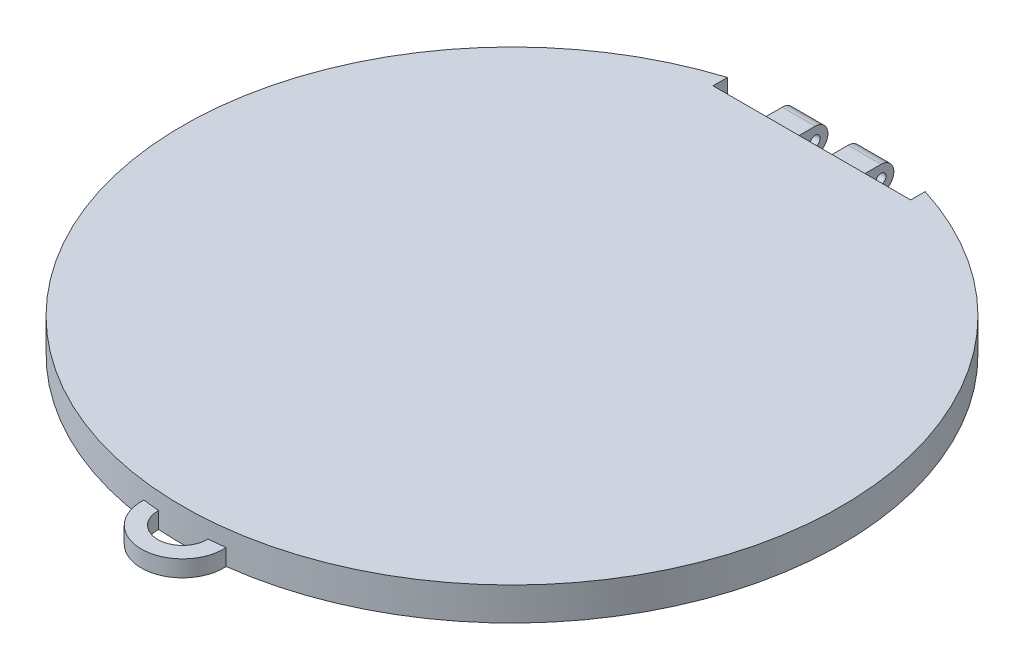
ISO-10303-21;
HEADER;
FILE_DESCRIPTION(('STEP AP214'),'2;1');
FILE_NAME('part.step','',(''),(''),'','','');
FILE_SCHEMA(('AUTOMOTIVE_DESIGN { 1 0 10303 214 1 1 1 1 }'));
ENDSEC;
DATA;
#1=APPLICATION_CONTEXT('core data for automotive mechanical design processes');
#2=APPLICATION_PROTOCOL_DEFINITION('international standard','automotive_design',2000,#1);
#3=PRODUCT_CONTEXT('',#1,'mechanical');
#4=PRODUCT('Part','Part','',(#3));
#5=PRODUCT_RELATED_PRODUCT_CATEGORY('part','',(#4));
#6=PRODUCT_DEFINITION_FORMATION('','',#4);
#7=PRODUCT_DEFINITION_CONTEXT('part definition',#1,'design');
#8=PRODUCT_DEFINITION('design','',#6,#7);
#9=PRODUCT_DEFINITION_SHAPE('','',#8);
#10=(LENGTH_UNIT() NAMED_UNIT(*) SI_UNIT(.MILLI.,.METRE.));
#11=(NAMED_UNIT(*) PLANE_ANGLE_UNIT() SI_UNIT($,.RADIAN.));
#12=(NAMED_UNIT(*) SI_UNIT($,.STERADIAN.) SOLID_ANGLE_UNIT());
#13=UNCERTAINTY_MEASURE_WITH_UNIT(LENGTH_MEASURE(1.E-05),#10,'distance_accuracy_value','');
#14=(GEOMETRIC_REPRESENTATION_CONTEXT(3) GLOBAL_UNCERTAINTY_ASSIGNED_CONTEXT((#13)) GLOBAL_UNIT_ASSIGNED_CONTEXT((#10,
#11,#12)) REPRESENTATION_CONTEXT('',''));
#15=CARTESIAN_POINT('',(0.,0.,0.));
#16=DIRECTION('',(0.,0.,1.));
#17=DIRECTION('',(1.,0.,0.));
#18=AXIS2_PLACEMENT_3D('',#15,#16,#17);
#19=CARTESIAN_POINT('',(30.,-10.,-91.));
#20=DIRECTION('',(0.,0.,1.));
#21=DIRECTION('',(1.,0.,0.));
#22=AXIS2_PLACEMENT_3D('',#19,#20,#21);
#23=PLANE('',#22);
#24=DIRECTION('',(0.,1.,0.));
#25=VECTOR('',#24,1.);
#26=CARTESIAN_POINT('',(4.99999999999998,-10.,-91.));
#27=LINE('',#26,#25);
#28=CARTESIAN_POINT('',(4.99999999999998,-10.,-91.));
#29=VERTEX_POINT('',#28);
#30=CARTESIAN_POINT('',(4.99999999999998,-4.12,-91.));
#31=VERTEX_POINT('',#30);
#32=EDGE_CURVE('E228',#29,#31,#27,.T.);
#33=ORIENTED_EDGE('',*,*,#32,.F.);
#34=DIRECTION('',(1.,0.,0.));
#35=VECTOR('',#34,1.);
#36=CARTESIAN_POINT('',(-30.,-10.,-91.));
#37=LINE('',#36,#35);
#38=CARTESIAN_POINT('',(15.,-10.,-91.));
#39=VERTEX_POINT('',#38);
#40=EDGE_CURVE('E251',#29,#39,#37,.T.);
#41=ORIENTED_EDGE('',*,*,#40,.T.);
#42=DIRECTION('',(0.,-1.,0.));
#43=VECTOR('',#42,1.);
#44=CARTESIAN_POINT('',(15.,-4.12,-91.));
#45=LINE('',#44,#43);
#46=CARTESIAN_POINT('',(15.,-4.12,-91.));
#47=VERTEX_POINT('',#46);
#48=EDGE_CURVE('E222',#47,#39,#45,.T.);
#49=ORIENTED_EDGE('',*,*,#48,.F.);
#50=DIRECTION('',(1.,0.,0.));
#51=VECTOR('',#50,1.);
#52=CARTESIAN_POINT('',(4.99999999999998,-4.12,-91.));
#53=LINE('',#52,#51);
#54=EDGE_CURVE('E225',#31,#47,#53,.T.);
#55=ORIENTED_EDGE('',*,*,#54,.F.);
#56=EDGE_LOOP('',(#33,#41,#49,#55));
#57=FACE_BOUND('',#56,.T.);
#58=DIRECTION('',(0.,1.,0.));
#59=VECTOR('',#58,1.);
#60=CARTESIAN_POINT('',(-15.,-4.12,-91.));
#61=LINE('',#60,#59);
#62=CARTESIAN_POINT('',(-15.,-10.,-91.));
#63=VERTEX_POINT('',#62);
#64=CARTESIAN_POINT('',(-15.,-4.12,-91.));
#65=VERTEX_POINT('',#64);
#66=EDGE_CURVE('E214',#63,#65,#61,.T.);
#67=ORIENTED_EDGE('',*,*,#66,.F.);
#68=CARTESIAN_POINT('',(-5.00000000000002,-9.99999999999999,-91.));
#69=VERTEX_POINT('',#68);
#70=EDGE_CURVE('E254',#63,#69,#37,.T.);
#71=ORIENTED_EDGE('',*,*,#70,.T.);
#72=DIRECTION('',(0.,-1.,0.));
#73=VECTOR('',#72,1.);
#74=CARTESIAN_POINT('',(-5.00000000000002,-9.99999999999999,-91.));
#75=LINE('',#74,#73);
#76=CARTESIAN_POINT('',(-5.00000000000002,-4.11999999999999,-91.));
#77=VERTEX_POINT('',#76);
#78=EDGE_CURVE('E209',#77,#69,#75,.T.);
#79=ORIENTED_EDGE('',*,*,#78,.F.);
#80=DIRECTION('',(1.,0.,0.));
#81=VECTOR('',#80,1.);
#82=CARTESIAN_POINT('',(-5.00000000000002,-4.11999999999999,-91.));
#83=LINE('',#82,#81);
#84=EDGE_CURVE('E211',#65,#77,#83,.T.);
#85=ORIENTED_EDGE('',*,*,#84,.F.);
#86=EDGE_LOOP('',(#67,#71,#79,#85));
#87=FACE_BOUND('',#86,.T.);
#88=DIRECTION('',(-1.,0.,0.));
#89=VECTOR('',#88,1.);
#90=CARTESIAN_POINT('',(-30.,-3.,-91.));
#91=LINE('',#90,#89);
#92=CARTESIAN_POINT('',(30.,-3.,-91.));
#93=VERTEX_POINT('',#92);
#94=CARTESIAN_POINT('',(-30.,-3.,-91.));
#95=VERTEX_POINT('',#94);
#96=EDGE_CURVE('E270',#93,#95,#91,.T.);
#97=ORIENTED_EDGE('',*,*,#96,.F.);
#98=DIRECTION('',(0.,1.,0.));
#99=VECTOR('',#98,1.);
#100=CARTESIAN_POINT('',(30.,-10.,-91.));
#101=LINE('',#100,#99);
#102=CARTESIAN_POINT('',(30.,-13.,-91.));
#103=VERTEX_POINT('',#102);
#104=EDGE_CURVE('E191',#103,#93,#101,.T.);
#105=ORIENTED_EDGE('',*,*,#104,.F.);
#106=DIRECTION('',(1.,0.,0.));
#107=VECTOR('',#106,1.);
#108=CARTESIAN_POINT('',(-30.,-13.,-91.));
#109=LINE('',#108,#107);
#110=CARTESIAN_POINT('',(-30.,-13.,-91.));
#111=VERTEX_POINT('',#110);
#112=EDGE_CURVE('E258',#111,#103,#109,.T.);
#113=ORIENTED_EDGE('',*,*,#112,.F.);
#114=DIRECTION('',(0.,1.,0.));
#115=VECTOR('',#114,1.);
#116=CARTESIAN_POINT('',(-30.,-10.,-91.));
#117=LINE('',#116,#115);
#118=EDGE_CURVE('E192',#111,#95,#117,.T.);
#119=ORIENTED_EDGE('',*,*,#118,.T.);
#120=EDGE_LOOP('',(#97,#105,#113,#119));
#121=FACE_BOUND('',#120,.T.);
#122=ADVANCED_FACE('F35',(#57,#87,#121),#23,.F.);
#123=CARTESIAN_POINT('',(0.,-10.,0.));
#124=DIRECTION('',(0.,1.,0.));
#125=DIRECTION('',(0.,0.,1.));
#126=AXIS2_PLACEMENT_3D('',#123,#124,#125);
#127=CYLINDRICAL_SURFACE('',#126,100.);
#128=DIRECTION('',(0.,-1.,0.));
#129=VECTOR('',#128,1.);
#130=CARTESIAN_POINT('',(12.475562048962,-10.5,99.21875));
#131=LINE('',#130,#129);
#132=CARTESIAN_POINT('',(12.475562048962,-13.,99.21875));
#133=VERTEX_POINT('',#132);
#134=CARTESIAN_POINT('',(12.475562048962,-8.,99.21875));
#135=VERTEX_POINT('',#134);
#136=EDGE_CURVE('E276',#133,#135,#131,.F.);
#137=ORIENTED_EDGE('',*,*,#136,.F.);
#138=CARTESIAN_POINT('',(0.,-13.,0.));
#139=DIRECTION('',(0.,-1.,0.));
#140=DIRECTION('',(0.,0.,-1.));
#141=AXIS2_PLACEMENT_3D('',#138,#139,#140);
#142=CIRCLE('',#141,100.);
#143=CARTESIAN_POINT('',(30.,-13.,-95.3939201416946));
#144=VERTEX_POINT('',#143);
#145=EDGE_CURVE('E264',#144,#133,#142,.T.);
#146=ORIENTED_EDGE('',*,*,#145,.F.);
#147=DIRECTION('',(0.,1.,0.));
#148=VECTOR('',#147,1.);
#149=CARTESIAN_POINT('',(30.,-10.,-95.3939201416946));
#150=LINE('',#149,#148);
#151=CARTESIAN_POINT('',(30.,-3.,-95.3939201416946));
#152=VERTEX_POINT('',#151);
#153=EDGE_CURVE('E189',#152,#144,#150,.F.);
#154=ORIENTED_EDGE('',*,*,#153,.F.);
#155=CARTESIAN_POINT('',(0.,-3.,0.));
#156=DIRECTION('',(0.,1.,0.));
#157=DIRECTION('',(0.,0.,1.));
#158=AXIS2_PLACEMENT_3D('',#155,#156,#157);
#159=CIRCLE('',#158,100.);
#160=CARTESIAN_POINT('',(-30.,-3.,-95.3939201416946));
#161=VERTEX_POINT('',#160);
#162=EDGE_CURVE('E274',#161,#152,#159,.T.);
#163=ORIENTED_EDGE('',*,*,#162,.F.);
#164=DIRECTION('',(0.,1.,0.));
#165=VECTOR('',#164,1.);
#166=CARTESIAN_POINT('',(-30.,-10.,-95.3939201416946));
#167=LINE('',#166,#165);
#168=CARTESIAN_POINT('',(-30.,-13.,-95.3939201416946));
#169=VERTEX_POINT('',#168);
#170=EDGE_CURVE('E184',#169,#161,#167,.T.);
#171=ORIENTED_EDGE('',*,*,#170,.F.);
#172=CARTESIAN_POINT('',(-12.475562048962,-13.,99.21875));
#173=VERTEX_POINT('',#172);
#174=EDGE_CURVE('E268',#173,#169,#142,.T.);
#175=ORIENTED_EDGE('',*,*,#174,.F.);
#176=DIRECTION('',(0.,-1.,0.));
#177=VECTOR('',#176,1.);
#178=CARTESIAN_POINT('',(-12.475562048962,-10.5,99.21875));
#179=LINE('',#178,#177);
#180=CARTESIAN_POINT('',(-12.475562048962,-8.,99.21875));
#181=VERTEX_POINT('',#180);
#182=EDGE_CURVE('E164',#181,#173,#179,.T.);
#183=ORIENTED_EDGE('',*,*,#182,.F.);
#184=CARTESIAN_POINT('',(0.,-8.,0.));
#185=DIRECTION('',(0.,-1.,0.));
#186=DIRECTION('',(0.,0.,-1.));
#187=AXIS2_PLACEMENT_3D('',#184,#185,#186);
#188=CIRCLE('',#187,100.);
#189=CARTESIAN_POINT('',(-7.49472470725242,-8.,99.71875));
#190=VERTEX_POINT('',#189);
#191=EDGE_CURVE('E39',#181,#190,#188,.F.);
#192=ORIENTED_EDGE('',*,*,#191,.T.);
#193=DIRECTION('',(0.,-1.,0.));
#194=VECTOR('',#193,1.);
#195=CARTESIAN_POINT('',(-7.49472470725242,-10.5,99.71875));
#196=LINE('',#195,#194);
#197=CARTESIAN_POINT('',(-7.49472470725249,-13.,99.71875));
#198=VERTEX_POINT('',#197);
#199=EDGE_CURVE('E144',#190,#198,#196,.T.);
#200=ORIENTED_EDGE('',*,*,#199,.T.);
#201=CARTESIAN_POINT('',(7.49472470725242,-13.,99.71875));
#202=VERTEX_POINT('',#201);
#203=EDGE_CURVE('E267',#202,#198,#142,.T.);
#204=ORIENTED_EDGE('',*,*,#203,.F.);
#205=DIRECTION('',(0.,-1.,0.));
#206=VECTOR('',#205,1.);
#207=CARTESIAN_POINT('',(7.49472470725242,-10.5,99.71875));
#208=LINE('',#207,#206);
#209=CARTESIAN_POINT('',(7.49472470725242,-8.,99.71875));
#210=VERTEX_POINT('',#209);
#211=EDGE_CURVE('E150',#202,#210,#208,.F.);
#212=ORIENTED_EDGE('',*,*,#211,.T.);
#213=EDGE_CURVE('E11',#210,#135,#188,.F.);
#214=ORIENTED_EDGE('',*,*,#213,.T.);
#215=EDGE_LOOP('',(#137,#146,#154,#163,#171,#175,#183,#192,#200,#204,#212,#214));
#216=FACE_BOUND('',#215,.T.);
#217=ADVANCED_FACE('F162',(#216),#127,.T.);
#218=CARTESIAN_POINT('',(-30.,-10.,-91.));
#219=DIRECTION('',(-1.,0.,0.));
#220=DIRECTION('',(0.,0.,1.));
#221=AXIS2_PLACEMENT_3D('',#218,#219,#220);
#222=PLANE('',#221);
#223=DIRECTION('',(0.,0.,-1.));
#224=VECTOR('',#223,1.);
#225=CARTESIAN_POINT('',(-30.,-3.,-95.3939201416946));
#226=LINE('',#225,#224);
#227=EDGE_CURVE('E255',#95,#161,#226,.T.);
#228=ORIENTED_EDGE('',*,*,#227,.F.);
#229=ORIENTED_EDGE('',*,*,#118,.F.);
#230=DIRECTION('',(0.,0.,1.));
#231=VECTOR('',#230,1.);
#232=CARTESIAN_POINT('',(-30.,-13.,-95.3939201416946));
#233=LINE('',#232,#231);
#234=EDGE_CURVE('E261',#169,#111,#233,.T.);
#235=ORIENTED_EDGE('',*,*,#234,.F.);
#236=ORIENTED_EDGE('',*,*,#170,.T.);
#237=EDGE_LOOP('',(#228,#229,#235,#236));
#238=FACE_BOUND('',#237,.T.);
#239=ADVANCED_FACE('F331',(#238),#222,.F.);
#240=CARTESIAN_POINT('',(30.,-10.,-91.));
#241=DIRECTION('',(1.,0.,0.));
#242=DIRECTION('',(0.,0.,-1.));
#243=AXIS2_PLACEMENT_3D('',#240,#241,#242);
#244=PLANE('',#243);
#245=DIRECTION('',(0.,0.,1.));
#246=VECTOR('',#245,1.);
#247=CARTESIAN_POINT('',(30.,-3.,-91.));
#248=LINE('',#247,#246);
#249=EDGE_CURVE('E272',#152,#93,#248,.T.);
#250=ORIENTED_EDGE('',*,*,#249,.F.);
#251=ORIENTED_EDGE('',*,*,#153,.T.);
#252=DIRECTION('',(0.,0.,-1.));
#253=VECTOR('',#252,1.);
#254=CARTESIAN_POINT('',(30.,-13.,-91.));
#255=LINE('',#254,#253);
#256=EDGE_CURVE('E250',#103,#144,#255,.T.);
#257=ORIENTED_EDGE('',*,*,#256,.F.);
#258=ORIENTED_EDGE('',*,*,#104,.T.);
#259=EDGE_LOOP('',(#250,#251,#257,#258));
#260=FACE_BOUND('',#259,.T.);
#261=ADVANCED_FACE('F336',(#260),#244,.F.);
#262=CARTESIAN_POINT('',(0.,-10.,0.));
#263=DIRECTION('',(0.,1.,0.));
#264=DIRECTION('',(0.,0.,1.));
#265=AXIS2_PLACEMENT_3D('',#262,#263,#264);
#266=PLANE('',#265);
#267=ORIENTED_EDGE('',*,*,#70,.F.);
#268=DIRECTION('',(0.,0.,1.));
#269=VECTOR('',#268,1.);
#270=CARTESIAN_POINT('',(-15.,-9.99999999999999,-93.12));
#271=LINE('',#270,#269);
#272=CARTESIAN_POINT('',(-15.,-10.,-93.6751842156294));
#273=VERTEX_POINT('',#272);
#274=EDGE_CURVE('E195',#273,#63,#271,.T.);
#275=ORIENTED_EDGE('',*,*,#274,.F.);
#276=DIRECTION('',(1.,0.,0.));
#277=VECTOR('',#276,1.);
#278=CARTESIAN_POINT('',(-15.,-9.99999999999999,-93.6751842156294));
#279=LINE('',#278,#277);
#280=CARTESIAN_POINT('',(-5.00000000000002,-10.,-93.6751842156294));
#281=VERTEX_POINT('',#280);
#282=EDGE_CURVE('E239',#273,#281,#279,.T.);
#283=ORIENTED_EDGE('',*,*,#282,.T.);
#284=DIRECTION('',(0.,0.,1.));
#285=VECTOR('',#284,1.);
#286=CARTESIAN_POINT('',(-5.00000000000002,-9.99999999999999,-93.12));
#287=LINE('',#286,#285);
#288=EDGE_CURVE('E206',#281,#69,#287,.T.);
#289=ORIENTED_EDGE('',*,*,#288,.T.);
#290=EDGE_LOOP('',(#267,#275,#283,#289));
#291=FACE_BOUND('',#290,.T.);
#292=ADVANCED_FACE('F295',(#291),#266,.F.);
#293=ORIENTED_EDGE('',*,*,#40,.F.);
#294=DIRECTION('',(0.,0.,1.));
#295=VECTOR('',#294,1.);
#296=CARTESIAN_POINT('',(4.99999999999998,-10.,-93.12));
#297=LINE('',#296,#295);
#298=CARTESIAN_POINT('',(4.99999999999998,-10.,-93.6751842156294));
#299=VERTEX_POINT('',#298);
#300=EDGE_CURVE('E217',#299,#29,#297,.T.);
#301=ORIENTED_EDGE('',*,*,#300,.F.);
#302=DIRECTION('',(1.,0.,0.));
#303=VECTOR('',#302,1.);
#304=CARTESIAN_POINT('',(4.99999999999998,-10.,-93.6751842156294));
#305=LINE('',#304,#303);
#306=CARTESIAN_POINT('',(15.,-10.,-93.6751842156294));
#307=VERTEX_POINT('',#306);
#308=EDGE_CURVE('E247',#299,#307,#305,.T.);
#309=ORIENTED_EDGE('',*,*,#308,.T.);
#310=DIRECTION('',(0.,0.,1.));
#311=VECTOR('',#310,1.);
#312=CARTESIAN_POINT('',(15.,-10.,-93.12));
#313=LINE('',#312,#311);
#314=EDGE_CURVE('E220',#307,#39,#313,.T.);
#315=ORIENTED_EDGE('',*,*,#314,.T.);
#316=EDGE_LOOP('',(#293,#301,#309,#315));
#317=FACE_BOUND('',#316,.T.);
#318=ADVANCED_FACE('F341',(#317),#266,.F.);
#319=CARTESIAN_POINT('',(4.99999999999998,-7.99999999999999,-97.));
#320=DIRECTION('',(1.,0.,0.));
#321=DIRECTION('',(0.,1.,0.));
#322=AXIS2_PLACEMENT_3D('',#319,#320,#321);
#323=CYLINDRICAL_SURFACE('',#322,3.88);
#324=CARTESIAN_POINT('',(15.,-8.,-97.));
#325=DIRECTION('',(1.,0.,0.));
#326=DIRECTION('',(0.,1.,0.));
#327=AXIS2_PLACEMENT_3D('',#324,#325,#326);
#328=CIRCLE('',#327,3.88);
#329=CARTESIAN_POINT('',(15.,-4.11999999999999,-97.));
#330=VERTEX_POINT('',#329);
#331=EDGE_CURVE('E166',#307,#330,#328,.T.);
#332=ORIENTED_EDGE('',*,*,#331,.F.);
#333=ORIENTED_EDGE('',*,*,#308,.F.);
#334=CARTESIAN_POINT('',(4.99999999999998,-7.99999999999999,-97.));
#335=DIRECTION('',(1.,0.,0.));
#336=DIRECTION('',(0.,1.,0.));
#337=AXIS2_PLACEMENT_3D('',#334,#335,#336);
#338=CIRCLE('',#337,3.88);
#339=CARTESIAN_POINT('',(4.99999999999998,-4.11999999999999,-97.));
#340=VERTEX_POINT('',#339);
#341=EDGE_CURVE('E165',#299,#340,#338,.T.);
#342=ORIENTED_EDGE('',*,*,#341,.T.);
#343=DIRECTION('',(1.,0.,0.));
#344=VECTOR('',#343,1.);
#345=CARTESIAN_POINT('',(4.99999999999998,-4.11999999999999,-97.));
#346=LINE('',#345,#344);
#347=EDGE_CURVE('E180',#340,#330,#346,.T.);
#348=ORIENTED_EDGE('',*,*,#347,.T.);
#349=EDGE_LOOP('',(#332,#333,#342,#348));
#350=FACE_BOUND('',#349,.T.);
#351=ADVANCED_FACE('F37',(#350),#323,.T.);
#352=CARTESIAN_POINT('',(4.99999999999998,-7.99999999999999,-97.));
#353=DIRECTION('',(1.,0.,0.));
#354=DIRECTION('',(0.,1.,0.));
#355=AXIS2_PLACEMENT_3D('',#352,#353,#354);
#356=PLANE('',#355);
#357=ORIENTED_EDGE('',*,*,#341,.F.);
#358=ORIENTED_EDGE('',*,*,#300,.T.);
#359=ORIENTED_EDGE('',*,*,#32,.T.);
#360=DIRECTION('',(0.,0.,1.));
#361=VECTOR('',#360,1.);
#362=CARTESIAN_POINT('',(5.,-4.12,-100.881));
#363=LINE('',#362,#361);
#364=EDGE_CURVE('E181',#340,#31,#363,.T.);
#365=ORIENTED_EDGE('',*,*,#364,.F.);
#366=EDGE_LOOP('',(#357,#358,#359,#365));
#367=FACE_BOUND('',#366,.T.);
#368=CARTESIAN_POINT('',(4.99999999999998,-7.99999999999999,-97.));
#369=DIRECTION('',(1.,0.,0.));
#370=DIRECTION('',(0.,1.,0.));
#371=AXIS2_PLACEMENT_3D('',#368,#369,#370);
#372=CIRCLE('',#371,1.5);
#373=CARTESIAN_POINT('',(4.99999999999998,-6.5,-97.));
#374=VERTEX_POINT('',#373);
#375=EDGE_CURVE('E173',#374,#374,#372,.T.);
#376=ORIENTED_EDGE('',*,*,#375,.T.);
#377=EDGE_LOOP('',(#376));
#378=FACE_BOUND('',#377,.T.);
#379=ADVANCED_FACE('F347',(#367,#378),#356,.F.);
#380=CARTESIAN_POINT('',(15.,-8.,-97.));
#381=DIRECTION('',(1.,0.,0.));
#382=DIRECTION('',(0.,1.,0.));
#383=AXIS2_PLACEMENT_3D('',#380,#381,#382);
#384=PLANE('',#383);
#385=ORIENTED_EDGE('',*,*,#314,.F.);
#386=ORIENTED_EDGE('',*,*,#331,.T.);
#387=DIRECTION('',(0.,0.,1.));
#388=VECTOR('',#387,1.);
#389=CARTESIAN_POINT('',(15.,-4.12,-100.881));
#390=LINE('',#389,#388);
#391=EDGE_CURVE('E183',#330,#47,#390,.T.);
#392=ORIENTED_EDGE('',*,*,#391,.T.);
#393=ORIENTED_EDGE('',*,*,#48,.T.);
#394=EDGE_LOOP('',(#385,#386,#392,#393));
#395=FACE_BOUND('',#394,.T.);
#396=CARTESIAN_POINT('',(15.,-8.,-97.));
#397=DIRECTION('',(1.,0.,0.));
#398=DIRECTION('',(0.,1.,0.));
#399=AXIS2_PLACEMENT_3D('',#396,#397,#398);
#400=CIRCLE('',#399,1.5);
#401=CARTESIAN_POINT('',(15.,-6.5,-97.));
#402=VERTEX_POINT('',#401);
#403=EDGE_CURVE('E177',#402,#402,#400,.T.);
#404=ORIENTED_EDGE('',*,*,#403,.F.);
#405=EDGE_LOOP('',(#404));
#406=FACE_BOUND('',#405,.T.);
#407=ADVANCED_FACE('F345',(#395,#406),#384,.T.);
#408=CARTESIAN_POINT('',(-100.,-7.99999999999996,-97.));
#409=DIRECTION('',(1.,0.,0.));
#410=DIRECTION('',(0.,1.,0.));
#411=AXIS2_PLACEMENT_3D('',#408,#409,#410);
#412=CYLINDRICAL_SURFACE('',#411,1.5);
#413=ORIENTED_EDGE('',*,*,#403,.T.);
#414=EDGE_LOOP('',(#413));
#415=FACE_BOUND('',#414,.T.);
#416=ORIENTED_EDGE('',*,*,#375,.F.);
#417=EDGE_LOOP('',(#416));
#418=FACE_BOUND('',#417,.T.);
#419=ADVANCED_FACE('F320',(#415,#418),#412,.F.);
#420=CARTESIAN_POINT('',(15.,-4.12,-100.881));
#421=DIRECTION('',(0.,-1.,0.));
#422=DIRECTION('',(0.,0.,-1.));
#423=AXIS2_PLACEMENT_3D('',#420,#421,#422);
#424=PLANE('',#423);
#425=ORIENTED_EDGE('',*,*,#347,.F.);
#426=ORIENTED_EDGE('',*,*,#364,.T.);
#427=ORIENTED_EDGE('',*,*,#54,.T.);
#428=ORIENTED_EDGE('',*,*,#391,.F.);
#429=EDGE_LOOP('',(#425,#426,#427,#428));
#430=FACE_BOUND('',#429,.T.);
#431=ADVANCED_FACE('F313',(#430),#424,.F.);
#432=CARTESIAN_POINT('',(-15.,-7.99999999999999,-97.));
#433=DIRECTION('',(1.,0.,0.));
#434=DIRECTION('',(0.,0.,-1.));
#435=AXIS2_PLACEMENT_3D('',#432,#433,#434);
#436=CYLINDRICAL_SURFACE('',#435,3.88);
#437=CARTESIAN_POINT('',(-5.00000000000002,-7.99999999999999,-97.));
#438=DIRECTION('',(1.,0.,0.));
#439=DIRECTION('',(0.,0.,-1.));
#440=AXIS2_PLACEMENT_3D('',#437,#438,#439);
#441=CIRCLE('',#440,3.88);
#442=CARTESIAN_POINT('',(-5.00000000000002,-4.11999999999999,-97.));
#443=VERTEX_POINT('',#442);
#444=EDGE_CURVE('E240',#281,#443,#441,.T.);
#445=ORIENTED_EDGE('',*,*,#444,.F.);
#446=ORIENTED_EDGE('',*,*,#282,.F.);
#447=CARTESIAN_POINT('',(-15.,-7.99999999999999,-97.));
#448=DIRECTION('',(1.,0.,0.));
#449=DIRECTION('',(0.,0.,-1.));
#450=AXIS2_PLACEMENT_3D('',#447,#448,#449);
#451=CIRCLE('',#450,3.88);
#452=CARTESIAN_POINT('',(-15.,-4.11999999999999,-97.));
#453=VERTEX_POINT('',#452);
#454=EDGE_CURVE('E234',#273,#453,#451,.T.);
#455=ORIENTED_EDGE('',*,*,#454,.T.);
#456=DIRECTION('',(1.,0.,0.));
#457=VECTOR('',#456,1.);
#458=CARTESIAN_POINT('',(-15.,-4.11999999999999,-97.));
#459=LINE('',#458,#457);
#460=EDGE_CURVE('E231',#453,#443,#459,.T.);
#461=ORIENTED_EDGE('',*,*,#460,.T.);
#462=EDGE_LOOP('',(#445,#446,#455,#461));
#463=FACE_BOUND('',#462,.T.);
#464=ADVANCED_FACE('F311',(#463),#436,.T.);
#465=CARTESIAN_POINT('',(-15.,-4.12,-93.12));
#466=DIRECTION('',(1.,0.,0.));
#467=DIRECTION('',(0.,0.,-1.));
#468=AXIS2_PLACEMENT_3D('',#465,#466,#467);
#469=PLANE('',#468);
#470=ORIENTED_EDGE('',*,*,#66,.T.);
#471=DIRECTION('',(0.,0.,1.));
#472=VECTOR('',#471,1.);
#473=CARTESIAN_POINT('',(-15.,-4.12,-93.12));
#474=LINE('',#473,#472);
#475=EDGE_CURVE('E200',#453,#65,#474,.T.);
#476=ORIENTED_EDGE('',*,*,#475,.F.);
#477=ORIENTED_EDGE('',*,*,#454,.F.);
#478=ORIENTED_EDGE('',*,*,#274,.T.);
#479=EDGE_LOOP('',(#470,#476,#477,#478));
#480=FACE_BOUND('',#479,.T.);
#481=CARTESIAN_POINT('',(-15.,-7.99999999999999,-97.));
#482=DIRECTION('',(1.,0.,0.));
#483=DIRECTION('',(0.,0.,-1.));
#484=AXIS2_PLACEMENT_3D('',#481,#482,#483);
#485=CIRCLE('',#484,1.5);
#486=CARTESIAN_POINT('',(-15.,-7.99999999999999,-98.5));
#487=VERTEX_POINT('',#486);
#488=EDGE_CURVE('E238',#487,#487,#485,.T.);
#489=ORIENTED_EDGE('',*,*,#488,.T.);
#490=EDGE_LOOP('',(#489));
#491=FACE_BOUND('',#490,.T.);
#492=ADVANCED_FACE('F307',(#480,#491),#469,.F.);
#493=CARTESIAN_POINT('',(-5.00000000000002,-4.11999999999999,-93.12));
#494=DIRECTION('',(0.,-1.,0.));
#495=DIRECTION('',(1.,0.,0.));
#496=AXIS2_PLACEMENT_3D('',#493,#494,#495);
#497=PLANE('',#496);
#498=ORIENTED_EDGE('',*,*,#84,.T.);
#499=DIRECTION('',(0.,0.,1.));
#500=VECTOR('',#499,1.);
#501=CARTESIAN_POINT('',(-5.00000000000002,-4.11999999999999,-93.12));
#502=LINE('',#501,#500);
#503=EDGE_CURVE('E203',#443,#77,#502,.T.);
#504=ORIENTED_EDGE('',*,*,#503,.F.);
#505=ORIENTED_EDGE('',*,*,#460,.F.);
#506=ORIENTED_EDGE('',*,*,#475,.T.);
#507=EDGE_LOOP('',(#498,#504,#505,#506));
#508=FACE_BOUND('',#507,.T.);
#509=ADVANCED_FACE('F304',(#508),#497,.F.);
#510=CARTESIAN_POINT('',(-5.00000000000002,-9.99999999999999,-93.12));
#511=DIRECTION('',(-1.,0.,0.));
#512=DIRECTION('',(0.,0.,1.));
#513=AXIS2_PLACEMENT_3D('',#510,#511,#512);
#514=PLANE('',#513);
#515=ORIENTED_EDGE('',*,*,#288,.F.);
#516=ORIENTED_EDGE('',*,*,#444,.T.);
#517=ORIENTED_EDGE('',*,*,#503,.T.);
#518=ORIENTED_EDGE('',*,*,#78,.T.);
#519=EDGE_LOOP('',(#515,#516,#517,#518));
#520=FACE_BOUND('',#519,.T.);
#521=CARTESIAN_POINT('',(-5.00000000000002,-7.99999999999999,-97.));
#522=DIRECTION('',(1.,0.,0.));
#523=DIRECTION('',(0.,0.,-1.));
#524=AXIS2_PLACEMENT_3D('',#521,#522,#523);
#525=CIRCLE('',#524,1.5);
#526=CARTESIAN_POINT('',(-5.00000000000002,-7.99999999999999,-98.5));
#527=VERTEX_POINT('',#526);
#528=EDGE_CURVE('E235',#527,#527,#525,.T.);
#529=ORIENTED_EDGE('',*,*,#528,.F.);
#530=EDGE_LOOP('',(#529));
#531=FACE_BOUND('',#530,.T.);
#532=ADVANCED_FACE('F299',(#520,#531),#514,.F.);
#533=CARTESIAN_POINT('',(-100.,-7.99999999999996,-97.));
#534=DIRECTION('',(1.,0.,0.));
#535=DIRECTION('',(0.,1.,0.));
#536=AXIS2_PLACEMENT_3D('',#533,#534,#535);
#537=CYLINDRICAL_SURFACE('',#536,1.5);
#538=ORIENTED_EDGE('',*,*,#528,.T.);
#539=EDGE_LOOP('',(#538));
#540=FACE_BOUND('',#539,.T.);
#541=ORIENTED_EDGE('',*,*,#488,.F.);
#542=EDGE_LOOP('',(#541));
#543=FACE_BOUND('',#542,.T.);
#544=ADVANCED_FACE('F404',(#540,#543),#537,.F.);
#545=CARTESIAN_POINT('',(0.,-13.,0.));
#546=DIRECTION('',(0.,-1.,0.));
#547=DIRECTION('',(0.,0.,-1.));
#548=AXIS2_PLACEMENT_3D('',#545,#546,#547);
#549=PLANE('',#548);
#550=CARTESIAN_POINT('',(0.,-13.,100.));
#551=DIRECTION('',(0.,-1.,0.));
#552=DIRECTION('',(0.,0.,-1.));
#553=AXIS2_PLACEMENT_3D('',#550,#551,#552);
#554=CIRCLE('',#553,12.5);
#555=EDGE_CURVE('E158',#133,#173,#554,.T.);
#556=ORIENTED_EDGE('',*,*,#555,.T.);
#557=ORIENTED_EDGE('',*,*,#174,.T.);
#558=ORIENTED_EDGE('',*,*,#234,.T.);
#559=ORIENTED_EDGE('',*,*,#112,.T.);
#560=ORIENTED_EDGE('',*,*,#256,.T.);
#561=ORIENTED_EDGE('',*,*,#145,.T.);
#562=EDGE_LOOP('',(#556,#557,#558,#559,#560,#561));
#563=FACE_BOUND('',#562,.T.);
#564=ORIENTED_EDGE('',*,*,#203,.T.);
#565=CARTESIAN_POINT('',(0.,-13.,100.));
#566=DIRECTION('',(0.,-1.,0.));
#567=DIRECTION('',(0.,0.,-1.));
#568=AXIS2_PLACEMENT_3D('',#565,#566,#567);
#569=CIRCLE('',#568,7.49999999999999);
#570=EDGE_CURVE('E55',#202,#198,#569,.T.);
#571=ORIENTED_EDGE('',*,*,#570,.F.);
#572=EDGE_LOOP('',(#564,#571));
#573=FACE_BOUND('',#572,.T.);
#574=ADVANCED_FACE('F287',(#563,#573),#549,.T.);
#575=CARTESIAN_POINT('',(0.,-3.,0.));
#576=DIRECTION('',(0.,1.,0.));
#577=DIRECTION('',(0.,0.,1.));
#578=AXIS2_PLACEMENT_3D('',#575,#576,#577);
#579=PLANE('',#578);
#580=ORIENTED_EDGE('',*,*,#162,.T.);
#581=ORIENTED_EDGE('',*,*,#249,.T.);
#582=ORIENTED_EDGE('',*,*,#96,.T.);
#583=ORIENTED_EDGE('',*,*,#227,.T.);
#584=EDGE_LOOP('',(#580,#581,#582,#583));
#585=FACE_BOUND('',#584,.T.);
#586=ADVANCED_FACE('F435',(#585),#579,.T.);
#587=CARTESIAN_POINT('',(0.,-8.,100.));
#588=DIRECTION('',(0.,-1.,0.));
#589=DIRECTION('',(0.,0.,-1.));
#590=AXIS2_PLACEMENT_3D('',#587,#588,#589);
#591=CYLINDRICAL_SURFACE('',#590,12.5);
#592=ORIENTED_EDGE('',*,*,#555,.F.);
#593=ORIENTED_EDGE('',*,*,#136,.T.);
#594=CARTESIAN_POINT('',(0.,-8.,100.));
#595=DIRECTION('',(0.,-1.,0.));
#596=DIRECTION('',(0.,0.,-1.));
#597=AXIS2_PLACEMENT_3D('',#594,#595,#596);
#598=CIRCLE('',#597,12.5);
#599=EDGE_CURVE('E151',#135,#181,#598,.T.);
#600=ORIENTED_EDGE('',*,*,#599,.T.);
#601=ORIENTED_EDGE('',*,*,#182,.T.);
#602=EDGE_LOOP('',(#592,#593,#600,#601));
#603=FACE_BOUND('',#602,.T.);
#604=ADVANCED_FACE('F284',(#603),#591,.T.);
#605=CARTESIAN_POINT('',(0.,-8.,100.));
#606=DIRECTION('',(0.,-1.,0.));
#607=DIRECTION('',(0.,0.,-1.));
#608=AXIS2_PLACEMENT_3D('',#605,#606,#607);
#609=PLANE('',#608);
#610=ORIENTED_EDGE('',*,*,#191,.F.);
#611=ORIENTED_EDGE('',*,*,#599,.F.);
#612=ORIENTED_EDGE('',*,*,#213,.F.);
#613=CARTESIAN_POINT('',(0.,-8.,100.));
#614=DIRECTION('',(0.,-1.,0.));
#615=DIRECTION('',(0.,0.,-1.));
#616=AXIS2_PLACEMENT_3D('',#613,#614,#615);
#617=CIRCLE('',#616,7.49999999999999);
#618=EDGE_CURVE('E50',#210,#190,#617,.T.);
#619=ORIENTED_EDGE('',*,*,#618,.T.);
#620=EDGE_LOOP('',(#610,#611,#612,#619));
#621=FACE_BOUND('',#620,.T.);
#622=ADVANCED_FACE('F154',(#621),#609,.F.);
#623=CARTESIAN_POINT('',(0.,-8.,100.));
#624=DIRECTION('',(0.,-1.,0.));
#625=DIRECTION('',(0.,0.,-1.));
#626=AXIS2_PLACEMENT_3D('',#623,#624,#625);
#627=CYLINDRICAL_SURFACE('',#626,7.49999999999999);
#628=ORIENTED_EDGE('',*,*,#211,.F.);
#629=ORIENTED_EDGE('',*,*,#570,.T.);
#630=ORIENTED_EDGE('',*,*,#199,.F.);
#631=ORIENTED_EDGE('',*,*,#618,.F.);
#632=EDGE_LOOP('',(#628,#629,#630,#631));
#633=FACE_BOUND('',#632,.T.);
#634=ADVANCED_FACE('F145',(#633),#627,.F.);
#635=CLOSED_SHELL('',(#122,#217,#239,#261,#292,#318,#351,#379,#407,#419,#431,#464,#492,#509,
#532,#544,#574,#586,#604,#622,#634));
#636=MANIFOLD_SOLID_BREP('B2',#635);
#637=ADVANCED_BREP_SHAPE_REPRESENTATION('',(#18,#636),#14);
#638=SHAPE_DEFINITION_REPRESENTATION(#9,#637);
ENDSEC;
END-ISO-10303-21;
